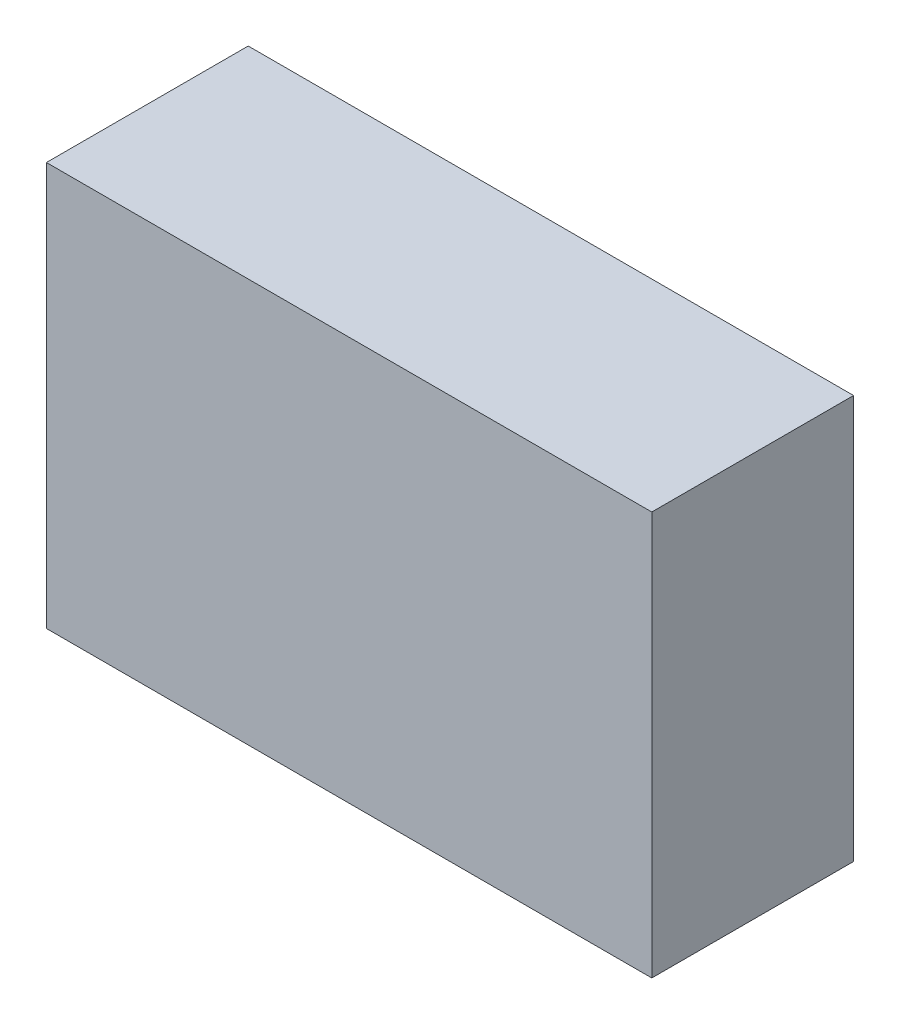
ISO-10303-21;
HEADER;
FILE_DESCRIPTION(('STEP AP214'),'2;1');
FILE_NAME('part.step','',(''),(''),'','','');
FILE_SCHEMA(('AUTOMOTIVE_DESIGN { 1 0 10303 214 1 1 1 1 }'));
ENDSEC;
DATA;
#1=APPLICATION_CONTEXT('core data for automotive mechanical design processes');
#2=APPLICATION_PROTOCOL_DEFINITION('international standard','automotive_design',2000,#1);
#3=PRODUCT_CONTEXT('',#1,'mechanical');
#4=PRODUCT('Part','Part','',(#3));
#5=PRODUCT_RELATED_PRODUCT_CATEGORY('part','',(#4));
#6=PRODUCT_DEFINITION_FORMATION('','',#4);
#7=PRODUCT_DEFINITION_CONTEXT('part definition',#1,'design');
#8=PRODUCT_DEFINITION('design','',#6,#7);
#9=PRODUCT_DEFINITION_SHAPE('','',#8);
#10=(LENGTH_UNIT() NAMED_UNIT(*) SI_UNIT(.MILLI.,.METRE.));
#11=(NAMED_UNIT(*) PLANE_ANGLE_UNIT() SI_UNIT($,.RADIAN.));
#12=(NAMED_UNIT(*) SI_UNIT($,.STERADIAN.) SOLID_ANGLE_UNIT());
#13=UNCERTAINTY_MEASURE_WITH_UNIT(LENGTH_MEASURE(1.E-05),#10,'distance_accuracy_value','');
#14=(GEOMETRIC_REPRESENTATION_CONTEXT(3) GLOBAL_UNCERTAINTY_ASSIGNED_CONTEXT((#13)) GLOBAL_UNIT_ASSIGNED_CONTEXT((#10,
#11,#12)) REPRESENTATION_CONTEXT('',''));
#15=CARTESIAN_POINT('',(0.,0.,0.));
#16=DIRECTION('',(0.,0.,1.));
#17=DIRECTION('',(1.,0.,0.));
#18=AXIS2_PLACEMENT_3D('',#15,#16,#17);
#19=CARTESIAN_POINT('',(22.5,30.,7.5));
#20=DIRECTION('',(-1.,0.,0.));
#21=DIRECTION('',(0.,0.,1.));
#22=AXIS2_PLACEMENT_3D('',#19,#20,#21);
#23=PLANE('',#22);
#24=DIRECTION('',(0.,0.,-1.));
#25=VECTOR('',#24,1.);
#26=CARTESIAN_POINT('',(22.5,0.,7.5));
#27=LINE('',#26,#25);
#28=CARTESIAN_POINT('',(22.5,0.,7.5));
#29=VERTEX_POINT('',#28);
#30=CARTESIAN_POINT('',(22.5,0.,-7.5));
#31=VERTEX_POINT('',#30);
#32=EDGE_CURVE('E96',#29,#31,#27,.T.);
#33=ORIENTED_EDGE('',*,*,#32,.T.);
#34=DIRECTION('',(0.,-1.,0.));
#35=VECTOR('',#34,1.);
#36=CARTESIAN_POINT('',(22.5,30.,-7.5));
#37=LINE('',#36,#35);
#38=CARTESIAN_POINT('',(22.5,30.,-7.5));
#39=VERTEX_POINT('',#38);
#40=EDGE_CURVE('E11',#39,#31,#37,.T.);
#41=ORIENTED_EDGE('',*,*,#40,.F.);
#42=DIRECTION('',(0.,0.,-1.));
#43=VECTOR('',#42,1.);
#44=CARTESIAN_POINT('',(22.5,30.,7.5));
#45=LINE('',#44,#43);
#46=CARTESIAN_POINT('',(22.5,30.,7.5));
#47=VERTEX_POINT('',#46);
#48=EDGE_CURVE('E84',#47,#39,#45,.T.);
#49=ORIENTED_EDGE('',*,*,#48,.F.);
#50=DIRECTION('',(0.,-1.,0.));
#51=VECTOR('',#50,1.);
#52=CARTESIAN_POINT('',(22.5,30.,7.5));
#53=LINE('',#52,#51);
#54=EDGE_CURVE('E92',#47,#29,#53,.T.);
#55=ORIENTED_EDGE('',*,*,#54,.T.);
#56=EDGE_LOOP('',(#33,#41,#49,#55));
#57=FACE_BOUND('',#56,.T.);
#58=ADVANCED_FACE('F33',(#57),#23,.F.);
#59=CARTESIAN_POINT('',(-22.5,30.,-7.5));
#60=DIRECTION('',(0.,0.,1.));
#61=DIRECTION('',(1.,0.,0.));
#62=AXIS2_PLACEMENT_3D('',#59,#60,#61);
#63=PLANE('',#62);
#64=DIRECTION('',(-1.,0.,0.));
#65=VECTOR('',#64,1.);
#66=CARTESIAN_POINT('',(-22.5,0.,-7.5));
#67=LINE('',#66,#65);
#68=CARTESIAN_POINT('',(-22.5,0.,-7.5));
#69=VERTEX_POINT('',#68);
#70=EDGE_CURVE('E88',#31,#69,#67,.T.);
#71=ORIENTED_EDGE('',*,*,#70,.T.);
#72=DIRECTION('',(0.,-1.,0.));
#73=VECTOR('',#72,1.);
#74=CARTESIAN_POINT('',(-22.5,30.,-7.5));
#75=LINE('',#74,#73);
#76=CARTESIAN_POINT('',(-22.5,30.,-7.5));
#77=VERTEX_POINT('',#76);
#78=EDGE_CURVE('E41',#77,#69,#75,.T.);
#79=ORIENTED_EDGE('',*,*,#78,.F.);
#80=DIRECTION('',(-1.,0.,0.));
#81=VECTOR('',#80,1.);
#82=CARTESIAN_POINT('',(-22.5,30.,-7.5));
#83=LINE('',#82,#81);
#84=EDGE_CURVE('E79',#39,#77,#83,.T.);
#85=ORIENTED_EDGE('',*,*,#84,.F.);
#86=ORIENTED_EDGE('',*,*,#40,.T.);
#87=EDGE_LOOP('',(#71,#79,#85,#86));
#88=FACE_BOUND('',#87,.T.);
#89=ADVANCED_FACE('F87',(#88),#63,.F.);
#90=CARTESIAN_POINT('',(-22.5,30.,7.5));
#91=DIRECTION('',(1.,0.,0.));
#92=DIRECTION('',(0.,0.,-1.));
#93=AXIS2_PLACEMENT_3D('',#90,#91,#92);
#94=PLANE('',#93);
#95=DIRECTION('',(0.,0.,1.));
#96=VECTOR('',#95,1.);
#97=CARTESIAN_POINT('',(-22.5,0.,7.5));
#98=LINE('',#97,#96);
#99=CARTESIAN_POINT('',(-22.5,0.,7.5));
#100=VERTEX_POINT('',#99);
#101=EDGE_CURVE('E66',#69,#100,#98,.T.);
#102=ORIENTED_EDGE('',*,*,#101,.T.);
#103=DIRECTION('',(0.,-1.,0.));
#104=VECTOR('',#103,1.);
#105=CARTESIAN_POINT('',(-22.5,30.,7.5));
#106=LINE('',#105,#104);
#107=CARTESIAN_POINT('',(-22.5,30.,7.5));
#108=VERTEX_POINT('',#107);
#109=EDGE_CURVE('E89',#108,#100,#106,.T.);
#110=ORIENTED_EDGE('',*,*,#109,.F.);
#111=DIRECTION('',(0.,0.,1.));
#112=VECTOR('',#111,1.);
#113=CARTESIAN_POINT('',(-22.5,30.,7.5));
#114=LINE('',#113,#112);
#115=EDGE_CURVE('E82',#77,#108,#114,.T.);
#116=ORIENTED_EDGE('',*,*,#115,.F.);
#117=ORIENTED_EDGE('',*,*,#78,.T.);
#118=EDGE_LOOP('',(#102,#110,#116,#117));
#119=FACE_BOUND('',#118,.T.);
#120=ADVANCED_FACE('F90',(#119),#94,.F.);
#121=CARTESIAN_POINT('',(-22.5,30.,7.5));
#122=DIRECTION('',(0.,0.,-1.));
#123=DIRECTION('',(-1.,0.,0.));
#124=AXIS2_PLACEMENT_3D('',#121,#122,#123);
#125=PLANE('',#124);
#126=DIRECTION('',(1.,0.,0.));
#127=VECTOR('',#126,1.);
#128=CARTESIAN_POINT('',(-22.5,0.,7.5));
#129=LINE('',#128,#127);
#130=EDGE_CURVE('E72',#100,#29,#129,.T.);
#131=ORIENTED_EDGE('',*,*,#130,.T.);
#132=ORIENTED_EDGE('',*,*,#54,.F.);
#133=DIRECTION('',(1.,0.,0.));
#134=VECTOR('',#133,1.);
#135=CARTESIAN_POINT('',(-22.5,30.,7.5));
#136=LINE('',#135,#134);
#137=EDGE_CURVE('E49',#108,#47,#136,.T.);
#138=ORIENTED_EDGE('',*,*,#137,.F.);
#139=ORIENTED_EDGE('',*,*,#109,.T.);
#140=EDGE_LOOP('',(#131,#132,#138,#139));
#141=FACE_BOUND('',#140,.T.);
#142=ADVANCED_FACE('F103',(#141),#125,.F.);
#143=CARTESIAN_POINT('',(0.,30.,0.));
#144=DIRECTION('',(0.,-1.,0.));
#145=DIRECTION('',(0.,0.,-1.));
#146=AXIS2_PLACEMENT_3D('',#143,#144,#145);
#147=PLANE('',#146);
#148=ORIENTED_EDGE('',*,*,#48,.T.);
#149=ORIENTED_EDGE('',*,*,#84,.T.);
#150=ORIENTED_EDGE('',*,*,#115,.T.);
#151=ORIENTED_EDGE('',*,*,#137,.T.);
#152=EDGE_LOOP('',(#148,#149,#150,#151));
#153=FACE_BOUND('',#152,.T.);
#154=ADVANCED_FACE('F80',(#153),#147,.F.);
#155=CARTESIAN_POINT('',(0.,0.,0.));
#156=DIRECTION('',(0.,-1.,0.));
#157=DIRECTION('',(0.,0.,-1.));
#158=AXIS2_PLACEMENT_3D('',#155,#156,#157);
#159=PLANE('',#158);
#160=ORIENTED_EDGE('',*,*,#32,.F.);
#161=ORIENTED_EDGE('',*,*,#130,.F.);
#162=ORIENTED_EDGE('',*,*,#101,.F.);
#163=ORIENTED_EDGE('',*,*,#70,.F.);
#164=EDGE_LOOP('',(#160,#161,#162,#163));
#165=FACE_BOUND('',#164,.T.);
#166=ADVANCED_FACE('F106',(#165),#159,.T.);
#167=CLOSED_SHELL('',(#58,#89,#120,#142,#154,#166));
#168=MANIFOLD_SOLID_BREP('B2',#167);
#169=ADVANCED_BREP_SHAPE_REPRESENTATION('',(#18,#168),#14);
#170=SHAPE_DEFINITION_REPRESENTATION(#9,#169);
ENDSEC;
END-ISO-10303-21;
